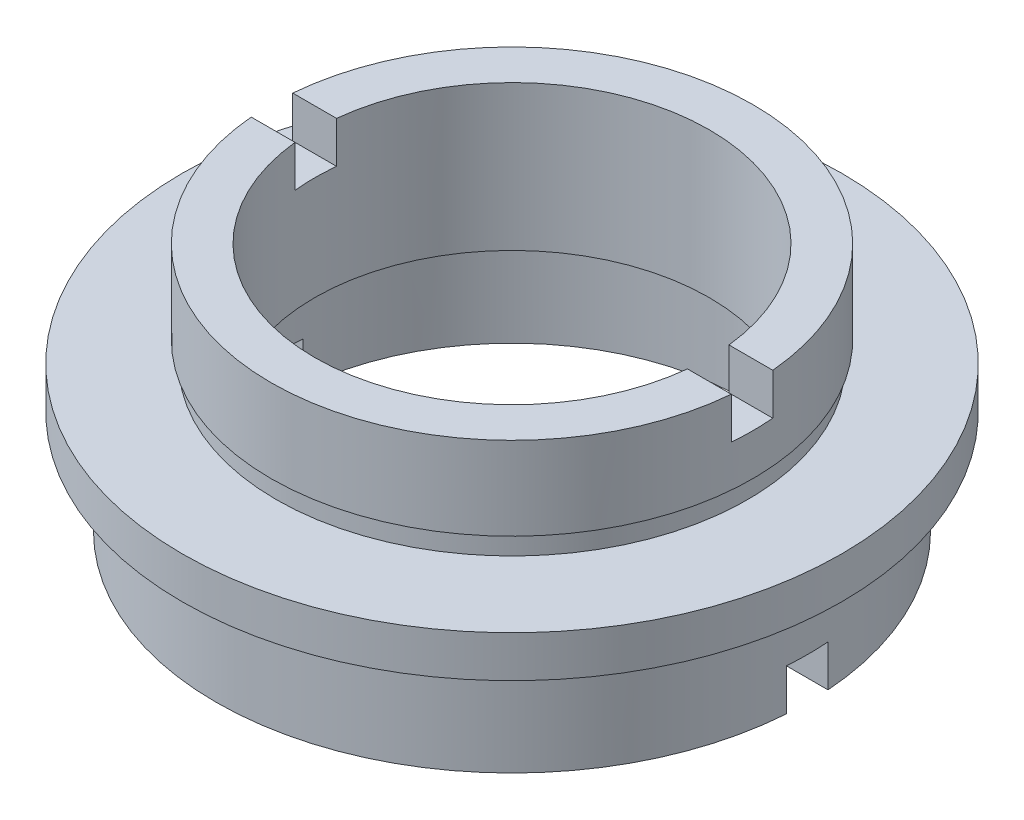
ISO-10303-21;
HEADER;
FILE_DESCRIPTION(('STEP AP214'),'2;1');
FILE_NAME('part.step','',(''),(''),'','','');
FILE_SCHEMA(('AUTOMOTIVE_DESIGN { 1 0 10303 214 1 1 1 1 }'));
ENDSEC;
DATA;
#1=APPLICATION_CONTEXT('core data for automotive mechanical design processes');
#2=APPLICATION_PROTOCOL_DEFINITION('international standard','automotive_design',2000,#1);
#3=PRODUCT_CONTEXT('',#1,'mechanical');
#4=PRODUCT('Part','Part','',(#3));
#5=PRODUCT_RELATED_PRODUCT_CATEGORY('part','',(#4));
#6=PRODUCT_DEFINITION_FORMATION('','',#4);
#7=PRODUCT_DEFINITION_CONTEXT('part definition',#1,'design');
#8=PRODUCT_DEFINITION('design','',#6,#7);
#9=PRODUCT_DEFINITION_SHAPE('','',#8);
#10=(LENGTH_UNIT() NAMED_UNIT(*) SI_UNIT(.MILLI.,.METRE.));
#11=(NAMED_UNIT(*) PLANE_ANGLE_UNIT() SI_UNIT($,.RADIAN.));
#12=(NAMED_UNIT(*) SI_UNIT($,.STERADIAN.) SOLID_ANGLE_UNIT());
#13=UNCERTAINTY_MEASURE_WITH_UNIT(LENGTH_MEASURE(1.E-05),#10,'distance_accuracy_value','');
#14=(GEOMETRIC_REPRESENTATION_CONTEXT(3) GLOBAL_UNCERTAINTY_ASSIGNED_CONTEXT((#13)) GLOBAL_UNIT_ASSIGNED_CONTEXT((#10,
#11,#12)) REPRESENTATION_CONTEXT('',''));
#15=CARTESIAN_POINT('',(0.,0.,0.));
#16=DIRECTION('',(0.,0.,1.));
#17=DIRECTION('',(1.,0.,0.));
#18=AXIS2_PLACEMENT_3D('',#15,#16,#17);
#19=CARTESIAN_POINT('',(-14.25,0.,0.));
#20=DIRECTION('',(0.,-1.,0.));
#21=DIRECTION('',(0.,0.,-1.));
#22=AXIS2_PLACEMENT_3D('',#19,#20,#21);
#23=PLANE('',#22);
#24=DIRECTION('',(-1.,0.,0.));
#25=VECTOR('',#24,1.);
#26=CARTESIAN_POINT('',(-14.25,0.,1.));
#27=LINE('',#26,#25);
#28=CARTESIAN_POINT('',(14.2148689758295,0.,1.));
#29=VERTEX_POINT('',#28);
#30=CARTESIAN_POINT('',(11.054863183233,0.,1.));
#31=VERTEX_POINT('',#30);
#32=EDGE_CURVE('E183',#29,#31,#27,.T.);
#33=ORIENTED_EDGE('',*,*,#32,.F.);
#34=CARTESIAN_POINT('',(0.,0.,0.));
#35=DIRECTION('',(0.,1.,0.));
#36=DIRECTION('',(0.,0.,1.));
#37=AXIS2_PLACEMENT_3D('',#34,#35,#36);
#38=CIRCLE('',#37,14.25);
#39=CARTESIAN_POINT('',(-14.2148689758295,0.,1.));
#40=VERTEX_POINT('',#39);
#41=EDGE_CURVE('E238',#40,#29,#38,.T.);
#42=ORIENTED_EDGE('',*,*,#41,.F.);
#43=CARTESIAN_POINT('',(-11.054863183233,0.,1.));
#44=VERTEX_POINT('',#43);
#45=EDGE_CURVE('E161',#44,#40,#27,.T.);
#46=ORIENTED_EDGE('',*,*,#45,.F.);
#47=CARTESIAN_POINT('',(0.,0.,0.));
#48=DIRECTION('',(0.,1.,0.));
#49=DIRECTION('',(0.,0.,1.));
#50=AXIS2_PLACEMENT_3D('',#47,#48,#49);
#51=CIRCLE('',#50,11.1);
#52=EDGE_CURVE('E234',#44,#31,#51,.T.);
#53=ORIENTED_EDGE('',*,*,#52,.T.);
#54=EDGE_LOOP('',(#33,#42,#46,#53));
#55=FACE_BOUND('',#54,.T.);
#56=ADVANCED_FACE('F38',(#55),#23,.T.);
#57=CARTESIAN_POINT('',(-9.5,12.,0.));
#58=DIRECTION('',(0.,1.,0.));
#59=DIRECTION('',(0.,0.,1.));
#60=AXIS2_PLACEMENT_3D('',#57,#58,#59);
#61=PLANE('',#60);
#62=DIRECTION('',(1.,0.,0.));
#63=VECTOR('',#62,1.);
#64=CARTESIAN_POINT('',(-9.5,12.,1.));
#65=LINE('',#64,#63);
#66=CARTESIAN_POINT('',(-11.5568161705549,12.,1.));
#67=VERTEX_POINT('',#66);
#68=CARTESIAN_POINT('',(-9.44722181384559,12.,1.));
#69=VERTEX_POINT('',#68);
#70=EDGE_CURVE('E270',#67,#69,#65,.T.);
#71=ORIENTED_EDGE('',*,*,#70,.F.);
#72=CARTESIAN_POINT('',(0.,12.,0.));
#73=DIRECTION('',(0.,1.,0.));
#74=DIRECTION('',(0.,0.,1.));
#75=AXIS2_PLACEMENT_3D('',#72,#73,#74);
#76=CIRCLE('',#75,11.6);
#77=CARTESIAN_POINT('',(11.5568161705549,12.,1.));
#78=VERTEX_POINT('',#77);
#79=EDGE_CURVE('E214',#67,#78,#76,.T.);
#80=ORIENTED_EDGE('',*,*,#79,.T.);
#81=CARTESIAN_POINT('',(9.44722181384559,12.,1.));
#82=VERTEX_POINT('',#81);
#83=EDGE_CURVE('E268',#82,#78,#65,.T.);
#84=ORIENTED_EDGE('',*,*,#83,.F.);
#85=CARTESIAN_POINT('',(0.,12.,0.));
#86=DIRECTION('',(0.,1.,0.));
#87=DIRECTION('',(0.,0.,1.));
#88=AXIS2_PLACEMENT_3D('',#85,#86,#87);
#89=CIRCLE('',#88,9.5);
#90=EDGE_CURVE('E218',#69,#82,#89,.T.);
#91=ORIENTED_EDGE('',*,*,#90,.F.);
#92=EDGE_LOOP('',(#71,#80,#84,#91));
#93=FACE_BOUND('',#92,.T.);
#94=ADVANCED_FACE('F319',(#93),#61,.T.);
#95=CARTESIAN_POINT('',(0.,22.6774994510759,0.));
#96=DIRECTION('',(0.,1.,0.));
#97=DIRECTION('',(0.,0.,1.));
#98=AXIS2_PLACEMENT_3D('',#95,#96,#97);
#99=CYLINDRICAL_SURFACE('',#98,11.6);
#100=DIRECTION('',(0.,1.,0.));
#101=VECTOR('',#100,1.);
#102=CARTESIAN_POINT('',(-11.5568161705549,22.6774994510759,1.));
#103=LINE('',#102,#101);
#104=CARTESIAN_POINT('',(-11.5568161705549,10.,1.));
#105=VERTEX_POINT('',#104);
#106=EDGE_CURVE('E209',#105,#67,#103,.T.);
#107=ORIENTED_EDGE('',*,*,#106,.F.);
#108=CARTESIAN_POINT('',(0.,10.,0.));
#109=DIRECTION('',(0.,-1.,0.));
#110=DIRECTION('',(0.,0.,-1.));
#111=AXIS2_PLACEMENT_3D('',#108,#109,#110);
#112=CIRCLE('',#111,11.6);
#113=CARTESIAN_POINT('',(-11.5568161705549,10.,-0.999999999999997));
#114=VERTEX_POINT('',#113);
#115=EDGE_CURVE('E213',#114,#105,#112,.F.);
#116=ORIENTED_EDGE('',*,*,#115,.F.);
#117=DIRECTION('',(0.,1.,0.));
#118=VECTOR('',#117,1.);
#119=CARTESIAN_POINT('',(-11.5568161705549,22.6774994510759,-1.));
#120=LINE('',#119,#118);
#121=CARTESIAN_POINT('',(-11.5568161705549,12.,-0.999999999999998));
#122=VERTEX_POINT('',#121);
#123=EDGE_CURVE('E197',#122,#114,#120,.F.);
#124=ORIENTED_EDGE('',*,*,#123,.F.);
#125=CARTESIAN_POINT('',(11.5568161705549,12.,-0.999999999999998));
#126=VERTEX_POINT('',#125);
#127=EDGE_CURVE('E217',#126,#122,#76,.T.);
#128=ORIENTED_EDGE('',*,*,#127,.F.);
#129=DIRECTION('',(0.,1.,0.));
#130=VECTOR('',#129,1.);
#131=CARTESIAN_POINT('',(11.5568161705549,22.6774994510759,-1.));
#132=LINE('',#131,#130);
#133=CARTESIAN_POINT('',(11.5568161705549,10.,-0.999999999999997));
#134=VERTEX_POINT('',#133);
#135=EDGE_CURVE('E201',#134,#126,#132,.T.);
#136=ORIENTED_EDGE('',*,*,#135,.F.);
#137=CARTESIAN_POINT('',(11.5568161705549,10.,1.));
#138=VERTEX_POINT('',#137);
#139=EDGE_CURVE('E211',#138,#134,#112,.F.);
#140=ORIENTED_EDGE('',*,*,#139,.F.);
#141=DIRECTION('',(0.,1.,0.));
#142=VECTOR('',#141,1.);
#143=CARTESIAN_POINT('',(11.5568161705549,22.6774994510759,1.));
#144=LINE('',#143,#142);
#145=EDGE_CURVE('E205',#78,#138,#144,.F.);
#146=ORIENTED_EDGE('',*,*,#145,.F.);
#147=ORIENTED_EDGE('',*,*,#79,.F.);
#148=EDGE_LOOP('',(#107,#116,#124,#128,#136,#140,#146,#147));
#149=FACE_BOUND('',#148,.T.);
#150=CARTESIAN_POINT('',(0.,8.,0.));
#151=DIRECTION('',(0.,1.,0.));
#152=DIRECTION('',(0.,0.,1.));
#153=AXIS2_PLACEMENT_3D('',#150,#151,#152);
#154=CIRCLE('',#153,11.6);
#155=CARTESIAN_POINT('',(0.,8.,11.6));
#156=VERTEX_POINT('',#155);
#157=EDGE_CURVE('E262',#156,#156,#154,.T.);
#158=ORIENTED_EDGE('',*,*,#157,.T.);
#159=EDGE_LOOP('',(#158));
#160=FACE_BOUND('',#159,.T.);
#161=ADVANCED_FACE('F40',(#149,#160),#99,.T.);
#162=CARTESIAN_POINT('',(-11.6,8.,0.));
#163=DIRECTION('',(0.,-1.,0.));
#164=DIRECTION('',(0.,0.,-1.));
#165=AXIS2_PLACEMENT_3D('',#162,#163,#164);
#166=PLANE('',#165);
#167=CARTESIAN_POINT('',(0.,8.,0.));
#168=DIRECTION('',(0.,1.,0.));
#169=DIRECTION('',(0.,0.,1.));
#170=AXIS2_PLACEMENT_3D('',#167,#168,#169);
#171=CIRCLE('',#170,11.35);
#172=CARTESIAN_POINT('',(0.,8.,11.35));
#173=VERTEX_POINT('',#172);
#174=EDGE_CURVE('E259',#173,#173,#171,.T.);
#175=ORIENTED_EDGE('',*,*,#174,.T.);
#176=EDGE_LOOP('',(#175));
#177=FACE_BOUND('',#176,.T.);
#178=ORIENTED_EDGE('',*,*,#157,.F.);
#179=EDGE_LOOP('',(#178));
#180=FACE_BOUND('',#179,.T.);
#181=ADVANCED_FACE('F329',(#177,#180),#166,.T.);
#182=CARTESIAN_POINT('',(0.,22.6774994510759,0.));
#183=DIRECTION('',(0.,1.,0.));
#184=DIRECTION('',(0.,0.,1.));
#185=AXIS2_PLACEMENT_3D('',#182,#183,#184);
#186=CYLINDRICAL_SURFACE('',#185,11.35);
#187=CARTESIAN_POINT('',(0.,7.,0.));
#188=DIRECTION('',(0.,1.,0.));
#189=DIRECTION('',(0.,0.,1.));
#190=AXIS2_PLACEMENT_3D('',#187,#188,#189);
#191=CIRCLE('',#190,11.35);
#192=CARTESIAN_POINT('',(0.,7.,11.35));
#193=VERTEX_POINT('',#192);
#194=EDGE_CURVE('E256',#193,#193,#191,.T.);
#195=ORIENTED_EDGE('',*,*,#194,.T.);
#196=EDGE_LOOP('',(#195));
#197=FACE_BOUND('',#196,.T.);
#198=ORIENTED_EDGE('',*,*,#174,.F.);
#199=EDGE_LOOP('',(#198));
#200=FACE_BOUND('',#199,.T.);
#201=ADVANCED_FACE('F569',(#197,#200),#186,.T.);
#202=CARTESIAN_POINT('',(-11.35,7.,0.));
#203=DIRECTION('',(0.,1.,0.));
#204=DIRECTION('',(0.,0.,1.));
#205=AXIS2_PLACEMENT_3D('',#202,#203,#204);
#206=PLANE('',#205);
#207=CARTESIAN_POINT('',(0.,7.,0.));
#208=DIRECTION('',(0.,1.,0.));
#209=DIRECTION('',(0.,0.,1.));
#210=AXIS2_PLACEMENT_3D('',#207,#208,#209);
#211=CIRCLE('',#210,15.875);
#212=CARTESIAN_POINT('',(0.,7.,15.875));
#213=VERTEX_POINT('',#212);
#214=EDGE_CURVE('E253',#213,#213,#211,.T.);
#215=ORIENTED_EDGE('',*,*,#214,.T.);
#216=EDGE_LOOP('',(#215));
#217=FACE_BOUND('',#216,.T.);
#218=ORIENTED_EDGE('',*,*,#194,.F.);
#219=EDGE_LOOP('',(#218));
#220=FACE_BOUND('',#219,.T.);
#221=ADVANCED_FACE('F560',(#217,#220),#206,.T.);
#222=CARTESIAN_POINT('',(0.,22.6774994510759,0.));
#223=DIRECTION('',(0.,1.,0.));
#224=DIRECTION('',(0.,0.,1.));
#225=AXIS2_PLACEMENT_3D('',#222,#223,#224);
#226=CYLINDRICAL_SURFACE('',#225,15.875);
#227=CARTESIAN_POINT('',(0.,5.,0.));
#228=DIRECTION('',(0.,1.,0.));
#229=DIRECTION('',(0.,0.,1.));
#230=AXIS2_PLACEMENT_3D('',#227,#228,#229);
#231=CIRCLE('',#230,15.875);
#232=CARTESIAN_POINT('',(0.,5.,15.875));
#233=VERTEX_POINT('',#232);
#234=EDGE_CURVE('E250',#233,#233,#231,.T.);
#235=ORIENTED_EDGE('',*,*,#234,.T.);
#236=EDGE_LOOP('',(#235));
#237=FACE_BOUND('',#236,.T.);
#238=ORIENTED_EDGE('',*,*,#214,.F.);
#239=EDGE_LOOP('',(#238));
#240=FACE_BOUND('',#239,.T.);
#241=ADVANCED_FACE('F551',(#237,#240),#226,.T.);
#242=CARTESIAN_POINT('',(-15.875,5.,0.));
#243=DIRECTION('',(0.,-1.,0.));
#244=DIRECTION('',(0.,0.,-1.));
#245=AXIS2_PLACEMENT_3D('',#242,#243,#244);
#246=PLANE('',#245);
#247=CARTESIAN_POINT('',(0.,5.,0.));
#248=DIRECTION('',(0.,1.,0.));
#249=DIRECTION('',(0.,0.,1.));
#250=AXIS2_PLACEMENT_3D('',#247,#248,#249);
#251=CIRCLE('',#250,13.75);
#252=CARTESIAN_POINT('',(0.,5.,13.75));
#253=VERTEX_POINT('',#252);
#254=EDGE_CURVE('E247',#253,#253,#251,.T.);
#255=ORIENTED_EDGE('',*,*,#254,.T.);
#256=EDGE_LOOP('',(#255));
#257=FACE_BOUND('',#256,.T.);
#258=ORIENTED_EDGE('',*,*,#234,.F.);
#259=EDGE_LOOP('',(#258));
#260=FACE_BOUND('',#259,.T.);
#261=ADVANCED_FACE('F542',(#257,#260),#246,.T.);
#262=CARTESIAN_POINT('',(0.,22.6774994510759,0.));
#263=DIRECTION('',(0.,1.,0.));
#264=DIRECTION('',(0.,0.,1.));
#265=AXIS2_PLACEMENT_3D('',#262,#263,#264);
#266=CYLINDRICAL_SURFACE('',#265,13.75);
#267=CARTESIAN_POINT('',(0.,4.,0.));
#268=DIRECTION('',(0.,1.,0.));
#269=DIRECTION('',(0.,0.,1.));
#270=AXIS2_PLACEMENT_3D('',#267,#268,#269);
#271=CIRCLE('',#270,13.75);
#272=CARTESIAN_POINT('',(0.,4.,13.75));
#273=VERTEX_POINT('',#272);
#274=EDGE_CURVE('E244',#273,#273,#271,.T.);
#275=ORIENTED_EDGE('',*,*,#274,.T.);
#276=EDGE_LOOP('',(#275));
#277=FACE_BOUND('',#276,.T.);
#278=ORIENTED_EDGE('',*,*,#254,.F.);
#279=EDGE_LOOP('',(#278));
#280=FACE_BOUND('',#279,.T.);
#281=ADVANCED_FACE('F533',(#277,#280),#266,.T.);
#282=CARTESIAN_POINT('',(-13.75,4.,0.));
#283=DIRECTION('',(0.,1.,0.));
#284=DIRECTION('',(0.,0.,1.));
#285=AXIS2_PLACEMENT_3D('',#282,#283,#284);
#286=PLANE('',#285);
#287=CARTESIAN_POINT('',(0.,4.,0.));
#288=DIRECTION('',(0.,1.,0.));
#289=DIRECTION('',(0.,0.,1.));
#290=AXIS2_PLACEMENT_3D('',#287,#288,#289);
#291=CIRCLE('',#290,14.25);
#292=CARTESIAN_POINT('',(0.,4.,14.25));
#293=VERTEX_POINT('',#292);
#294=EDGE_CURVE('E241',#293,#293,#291,.T.);
#295=ORIENTED_EDGE('',*,*,#294,.T.);
#296=EDGE_LOOP('',(#295));
#297=FACE_BOUND('',#296,.T.);
#298=ORIENTED_EDGE('',*,*,#274,.F.);
#299=EDGE_LOOP('',(#298));
#300=FACE_BOUND('',#299,.T.);
#301=ADVANCED_FACE('F316',(#297,#300),#286,.T.);
#302=CARTESIAN_POINT('',(0.,22.6774994510759,0.));
#303=DIRECTION('',(0.,1.,0.));
#304=DIRECTION('',(0.,0.,1.));
#305=AXIS2_PLACEMENT_3D('',#302,#303,#304);
#306=CYLINDRICAL_SURFACE('',#305,14.25);
#307=DIRECTION('',(0.,1.,0.));
#308=VECTOR('',#307,1.);
#309=CARTESIAN_POINT('',(-14.2148689758295,22.6774994510759,1.));
#310=LINE('',#309,#308);
#311=CARTESIAN_POINT('',(-14.2148689758295,2.,1.));
#312=VERTEX_POINT('',#311);
#313=EDGE_CURVE('E182',#40,#312,#310,.T.);
#314=ORIENTED_EDGE('',*,*,#313,.F.);
#315=ORIENTED_EDGE('',*,*,#41,.T.);
#316=DIRECTION('',(0.,1.,0.));
#317=VECTOR('',#316,1.);
#318=CARTESIAN_POINT('',(14.2148689758295,22.6774994510759,1.));
#319=LINE('',#318,#317);
#320=CARTESIAN_POINT('',(14.2148689758295,2.,1.));
#321=VERTEX_POINT('',#320);
#322=EDGE_CURVE('E185',#321,#29,#319,.F.);
#323=ORIENTED_EDGE('',*,*,#322,.F.);
#324=CARTESIAN_POINT('',(0.,2.,0.));
#325=DIRECTION('',(0.,1.,0.));
#326=DIRECTION('',(0.,0.,1.));
#327=AXIS2_PLACEMENT_3D('',#324,#325,#326);
#328=CIRCLE('',#327,14.25);
#329=CARTESIAN_POINT('',(14.2148689758295,2.,-1.));
#330=VERTEX_POINT('',#329);
#331=EDGE_CURVE('E162',#330,#321,#328,.F.);
#332=ORIENTED_EDGE('',*,*,#331,.F.);
#333=DIRECTION('',(0.,1.,0.));
#334=VECTOR('',#333,1.);
#335=CARTESIAN_POINT('',(14.2148689758295,22.6774994510759,-0.999999999999994));
#336=LINE('',#335,#334);
#337=CARTESIAN_POINT('',(14.2148689758295,0.,-1.));
#338=VERTEX_POINT('',#337);
#339=EDGE_CURVE('E176',#338,#330,#336,.T.);
#340=ORIENTED_EDGE('',*,*,#339,.F.);
#341=CARTESIAN_POINT('',(-14.2148689758295,0.,-1.));
#342=VERTEX_POINT('',#341);
#343=EDGE_CURVE('E174',#338,#342,#38,.T.);
#344=ORIENTED_EDGE('',*,*,#343,.T.);
#345=DIRECTION('',(0.,1.,0.));
#346=VECTOR('',#345,1.);
#347=CARTESIAN_POINT('',(-14.2148689758295,22.6774994510759,-0.999999999999994));
#348=LINE('',#347,#346);
#349=CARTESIAN_POINT('',(-14.2148689758295,2.,-1.));
#350=VERTEX_POINT('',#349);
#351=EDGE_CURVE('E165',#350,#342,#348,.F.);
#352=ORIENTED_EDGE('',*,*,#351,.F.);
#353=EDGE_CURVE('E151',#312,#350,#328,.F.);
#354=ORIENTED_EDGE('',*,*,#353,.F.);
#355=EDGE_LOOP('',(#314,#315,#323,#332,#340,#344,#352,#354));
#356=FACE_BOUND('',#355,.T.);
#357=ORIENTED_EDGE('',*,*,#294,.F.);
#358=EDGE_LOOP('',(#357));
#359=FACE_BOUND('',#358,.T.);
#360=ADVANCED_FACE('F170',(#356,#359),#306,.T.);
#361=DIRECTION('',(1.,0.,0.));
#362=VECTOR('',#361,1.);
#363=CARTESIAN_POINT('',(-14.25,0.,-1.));
#364=LINE('',#363,#362);
#365=CARTESIAN_POINT('',(-11.054863183233,0.,-0.999999999999995));
#366=VERTEX_POINT('',#365);
#367=EDGE_CURVE('E61',#342,#366,#364,.T.);
#368=ORIENTED_EDGE('',*,*,#367,.F.);
#369=ORIENTED_EDGE('',*,*,#343,.F.);
#370=CARTESIAN_POINT('',(11.054863183233,0.,-0.999999999999994));
#371=VERTEX_POINT('',#370);
#372=EDGE_CURVE('E178',#371,#338,#364,.T.);
#373=ORIENTED_EDGE('',*,*,#372,.F.);
#374=EDGE_CURVE('E237',#371,#366,#51,.T.);
#375=ORIENTED_EDGE('',*,*,#374,.T.);
#376=EDGE_LOOP('',(#368,#369,#373,#375));
#377=FACE_BOUND('',#376,.T.);
#378=ADVANCED_FACE('F307',(#377),#23,.T.);
#379=CARTESIAN_POINT('',(0.,22.6774994510759,0.));
#380=DIRECTION('',(0.,1.,0.));
#381=DIRECTION('',(0.,0.,1.));
#382=AXIS2_PLACEMENT_3D('',#379,#380,#381);
#383=CYLINDRICAL_SURFACE('',#382,11.1);
#384=DIRECTION('',(0.,1.,0.));
#385=VECTOR('',#384,1.);
#386=CARTESIAN_POINT('',(-11.054863183233,22.6774994510759,1.));
#387=LINE('',#386,#385);
#388=CARTESIAN_POINT('',(-11.054863183233,2.,1.));
#389=VERTEX_POINT('',#388);
#390=EDGE_CURVE('E12',#389,#44,#387,.F.);
#391=ORIENTED_EDGE('',*,*,#390,.F.);
#392=CARTESIAN_POINT('',(0.,2.,0.));
#393=DIRECTION('',(0.,1.,0.));
#394=DIRECTION('',(0.,0.,1.));
#395=AXIS2_PLACEMENT_3D('',#392,#393,#394);
#396=CIRCLE('',#395,11.1);
#397=CARTESIAN_POINT('',(-11.054863183233,2.,-1.));
#398=VERTEX_POINT('',#397);
#399=EDGE_CURVE('E46',#398,#389,#396,.T.);
#400=ORIENTED_EDGE('',*,*,#399,.F.);
#401=DIRECTION('',(0.,1.,0.));
#402=VECTOR('',#401,1.);
#403=CARTESIAN_POINT('',(-11.054863183233,22.6774994510759,-0.999999999999994));
#404=LINE('',#403,#402);
#405=EDGE_CURVE('E166',#366,#398,#404,.T.);
#406=ORIENTED_EDGE('',*,*,#405,.F.);
#407=ORIENTED_EDGE('',*,*,#374,.F.);
#408=DIRECTION('',(0.,1.,0.));
#409=VECTOR('',#408,1.);
#410=CARTESIAN_POINT('',(11.054863183233,22.6774994510759,-0.999999999999994));
#411=LINE('',#410,#409);
#412=CARTESIAN_POINT('',(11.054863183233,2.,-0.999999999999994));
#413=VERTEX_POINT('',#412);
#414=EDGE_CURVE('E274',#413,#371,#411,.F.);
#415=ORIENTED_EDGE('',*,*,#414,.F.);
#416=CARTESIAN_POINT('',(11.054863183233,2.,1.));
#417=VERTEX_POINT('',#416);
#418=EDGE_CURVE('E276',#417,#413,#396,.T.);
#419=ORIENTED_EDGE('',*,*,#418,.F.);
#420=DIRECTION('',(0.,1.,0.));
#421=VECTOR('',#420,1.);
#422=CARTESIAN_POINT('',(11.054863183233,22.6774994510759,1.));
#423=LINE('',#422,#421);
#424=EDGE_CURVE('E278',#31,#417,#423,.T.);
#425=ORIENTED_EDGE('',*,*,#424,.F.);
#426=ORIENTED_EDGE('',*,*,#52,.F.);
#427=EDGE_LOOP('',(#391,#400,#406,#407,#415,#419,#425,#426));
#428=FACE_BOUND('',#427,.T.);
#429=CARTESIAN_POINT('',(0.,4.,0.));
#430=DIRECTION('',(0.,1.,0.));
#431=DIRECTION('',(0.,0.,1.));
#432=AXIS2_PLACEMENT_3D('',#429,#430,#431);
#433=CIRCLE('',#432,11.1);
#434=CARTESIAN_POINT('',(0.,4.,11.1));
#435=VERTEX_POINT('',#434);
#436=EDGE_CURVE('E231',#435,#435,#433,.T.);
#437=ORIENTED_EDGE('',*,*,#436,.T.);
#438=EDGE_LOOP('',(#437));
#439=FACE_BOUND('',#438,.T.);
#440=ADVANCED_FACE('F286',(#428,#439),#383,.F.);
#441=CARTESIAN_POINT('',(-11.7,4.,0.));
#442=DIRECTION('',(0.,1.,0.));
#443=DIRECTION('',(0.,0.,1.));
#444=AXIS2_PLACEMENT_3D('',#441,#442,#443);
#445=PLANE('',#444);
#446=CARTESIAN_POINT('',(0.,4.,0.));
#447=DIRECTION('',(0.,1.,0.));
#448=DIRECTION('',(0.,0.,1.));
#449=AXIS2_PLACEMENT_3D('',#446,#447,#448);
#450=CIRCLE('',#449,11.7);
#451=CARTESIAN_POINT('',(0.,4.,11.7));
#452=VERTEX_POINT('',#451);
#453=EDGE_CURVE('E228',#452,#452,#450,.T.);
#454=ORIENTED_EDGE('',*,*,#453,.T.);
#455=EDGE_LOOP('',(#454));
#456=FACE_BOUND('',#455,.T.);
#457=ORIENTED_EDGE('',*,*,#436,.F.);
#458=EDGE_LOOP('',(#457));
#459=FACE_BOUND('',#458,.T.);
#460=ADVANCED_FACE('F314',(#456,#459),#445,.T.);
#461=CARTESIAN_POINT('',(0.,22.6774994510759,0.));
#462=DIRECTION('',(0.,1.,0.));
#463=DIRECTION('',(0.,0.,1.));
#464=AXIS2_PLACEMENT_3D('',#461,#462,#463);
#465=CYLINDRICAL_SURFACE('',#464,11.7);
#466=CARTESIAN_POINT('',(0.,5.,0.));
#467=DIRECTION('',(0.,1.,0.));
#468=DIRECTION('',(0.,0.,1.));
#469=AXIS2_PLACEMENT_3D('',#466,#467,#468);
#470=CIRCLE('',#469,11.7);
#471=CARTESIAN_POINT('',(0.,5.,11.7));
#472=VERTEX_POINT('',#471);
#473=EDGE_CURVE('E225',#472,#472,#470,.T.);
#474=ORIENTED_EDGE('',*,*,#473,.T.);
#475=EDGE_LOOP('',(#474));
#476=FACE_BOUND('',#475,.T.);
#477=ORIENTED_EDGE('',*,*,#453,.F.);
#478=EDGE_LOOP('',(#477));
#479=FACE_BOUND('',#478,.T.);
#480=ADVANCED_FACE('F492',(#476,#479),#465,.F.);
#481=CARTESIAN_POINT('',(-9.5,5.,0.));
#482=DIRECTION('',(0.,-1.,0.));
#483=DIRECTION('',(0.,0.,-1.));
#484=AXIS2_PLACEMENT_3D('',#481,#482,#483);
#485=PLANE('',#484);
#486=CARTESIAN_POINT('',(0.,5.,0.));
#487=DIRECTION('',(0.,1.,0.));
#488=DIRECTION('',(0.,0.,1.));
#489=AXIS2_PLACEMENT_3D('',#486,#487,#488);
#490=CIRCLE('',#489,9.5);
#491=CARTESIAN_POINT('',(0.,5.,9.5));
#492=VERTEX_POINT('',#491);
#493=EDGE_CURVE('E222',#492,#492,#490,.T.);
#494=ORIENTED_EDGE('',*,*,#493,.T.);
#495=EDGE_LOOP('',(#494));
#496=FACE_BOUND('',#495,.T.);
#497=ORIENTED_EDGE('',*,*,#473,.F.);
#498=EDGE_LOOP('',(#497));
#499=FACE_BOUND('',#498,.T.);
#500=ADVANCED_FACE('F345',(#496,#499),#485,.T.);
#501=CARTESIAN_POINT('',(0.,22.6774994510759,0.));
#502=DIRECTION('',(0.,1.,0.));
#503=DIRECTION('',(0.,0.,1.));
#504=AXIS2_PLACEMENT_3D('',#501,#502,#503);
#505=CYLINDRICAL_SURFACE('',#504,9.5);
#506=DIRECTION('',(0.,1.,0.));
#507=VECTOR('',#506,1.);
#508=CARTESIAN_POINT('',(9.44722181384559,22.6774994510759,1.));
#509=LINE('',#508,#507);
#510=CARTESIAN_POINT('',(9.44722181384559,10.,1.));
#511=VERTEX_POINT('',#510);
#512=EDGE_CURVE('E203',#511,#82,#509,.T.);
#513=ORIENTED_EDGE('',*,*,#512,.F.);
#514=CARTESIAN_POINT('',(0.,10.,0.));
#515=DIRECTION('',(0.,-1.,0.));
#516=DIRECTION('',(0.,0.,-1.));
#517=AXIS2_PLACEMENT_3D('',#514,#515,#516);
#518=CIRCLE('',#517,9.5);
#519=CARTESIAN_POINT('',(9.44722181384559,10.,-0.999999999999997));
#520=VERTEX_POINT('',#519);
#521=EDGE_CURVE('E273',#520,#511,#518,.T.);
#522=ORIENTED_EDGE('',*,*,#521,.F.);
#523=DIRECTION('',(0.,1.,0.));
#524=VECTOR('',#523,1.);
#525=CARTESIAN_POINT('',(9.44722181384559,22.6774994510759,-1.));
#526=LINE('',#525,#524);
#527=CARTESIAN_POINT('',(9.44722181384559,12.,-0.999999999999998));
#528=VERTEX_POINT('',#527);
#529=EDGE_CURVE('E199',#528,#520,#526,.F.);
#530=ORIENTED_EDGE('',*,*,#529,.F.);
#531=CARTESIAN_POINT('',(-9.44722181384559,12.,-0.999999999999998));
#532=VERTEX_POINT('',#531);
#533=EDGE_CURVE('E221',#528,#532,#89,.T.);
#534=ORIENTED_EDGE('',*,*,#533,.T.);
#535=DIRECTION('',(0.,1.,0.));
#536=VECTOR('',#535,1.);
#537=CARTESIAN_POINT('',(-9.44722181384559,22.6774994510759,-1.));
#538=LINE('',#537,#536);
#539=CARTESIAN_POINT('',(-9.44722181384559,10.,-0.999999999999997));
#540=VERTEX_POINT('',#539);
#541=EDGE_CURVE('E195',#540,#532,#538,.T.);
#542=ORIENTED_EDGE('',*,*,#541,.F.);
#543=CARTESIAN_POINT('',(-9.44722181384559,10.,1.));
#544=VERTEX_POINT('',#543);
#545=EDGE_CURVE('E271',#544,#540,#518,.T.);
#546=ORIENTED_EDGE('',*,*,#545,.F.);
#547=DIRECTION('',(0.,1.,0.));
#548=VECTOR('',#547,1.);
#549=CARTESIAN_POINT('',(-9.44722181384559,22.6774994510759,1.));
#550=LINE('',#549,#548);
#551=EDGE_CURVE('E207',#69,#544,#550,.F.);
#552=ORIENTED_EDGE('',*,*,#551,.F.);
#553=ORIENTED_EDGE('',*,*,#90,.T.);
#554=EDGE_LOOP('',(#513,#522,#530,#534,#542,#546,#552,#553));
#555=FACE_BOUND('',#554,.T.);
#556=ORIENTED_EDGE('',*,*,#493,.F.);
#557=EDGE_LOOP('',(#556));
#558=FACE_BOUND('',#557,.T.);
#559=ADVANCED_FACE('F336',(#555,#558),#505,.F.);
#560=DIRECTION('',(-1.,0.,0.));
#561=VECTOR('',#560,1.);
#562=CARTESIAN_POINT('',(-9.5,12.,-0.999999999999998));
#563=LINE('',#562,#561);
#564=EDGE_CURVE('E267',#126,#528,#563,.T.);
#565=ORIENTED_EDGE('',*,*,#564,.F.);
#566=ORIENTED_EDGE('',*,*,#127,.T.);
#567=EDGE_CURVE('E265',#532,#122,#563,.T.);
#568=ORIENTED_EDGE('',*,*,#567,.F.);
#569=ORIENTED_EDGE('',*,*,#533,.F.);
#570=EDGE_LOOP('',(#565,#566,#568,#569));
#571=FACE_BOUND('',#570,.T.);
#572=ADVANCED_FACE('F325',(#571),#61,.T.);
#573=CARTESIAN_POINT('',(-39.5,13.5939878717808,1.));
#574=DIRECTION('',(0.,0.,1.));
#575=DIRECTION('',(0.,-1.,0.));
#576=AXIS2_PLACEMENT_3D('',#573,#574,#575);
#577=PLANE('',#576);
#578=ORIENTED_EDGE('',*,*,#106,.T.);
#579=ORIENTED_EDGE('',*,*,#70,.T.);
#580=ORIENTED_EDGE('',*,*,#551,.T.);
#581=DIRECTION('',(1.,0.,0.));
#582=VECTOR('',#581,1.);
#583=CARTESIAN_POINT('',(-39.5,10.,1.));
#584=LINE('',#583,#582);
#585=EDGE_CURVE('E192',#105,#544,#584,.T.);
#586=ORIENTED_EDGE('',*,*,#585,.F.);
#587=EDGE_LOOP('',(#578,#579,#580,#586));
#588=FACE_BOUND('',#587,.T.);
#589=ADVANCED_FACE('F335',(#588),#577,.F.);
#590=CARTESIAN_POINT('',(-39.5,13.5939878717808,-0.999999999999998));
#591=DIRECTION('',(0.,0.,-1.));
#592=DIRECTION('',(0.,1.,0.));
#593=AXIS2_PLACEMENT_3D('',#590,#591,#592);
#594=PLANE('',#593);
#595=ORIENTED_EDGE('',*,*,#123,.T.);
#596=DIRECTION('',(1.,0.,0.));
#597=VECTOR('',#596,1.);
#598=CARTESIAN_POINT('',(-39.5,10.,-0.999999999999997));
#599=LINE('',#598,#597);
#600=EDGE_CURVE('E191',#114,#540,#599,.T.);
#601=ORIENTED_EDGE('',*,*,#600,.T.);
#602=ORIENTED_EDGE('',*,*,#541,.T.);
#603=ORIENTED_EDGE('',*,*,#567,.T.);
#604=EDGE_LOOP('',(#595,#601,#602,#603));
#605=FACE_BOUND('',#604,.T.);
#606=ADVANCED_FACE('F342',(#605),#594,.F.);
#607=CARTESIAN_POINT('',(-39.5,10.,1.));
#608=DIRECTION('',(0.,-1.,0.));
#609=DIRECTION('',(0.,0.,-1.));
#610=AXIS2_PLACEMENT_3D('',#607,#608,#609);
#611=PLANE('',#610);
#612=ORIENTED_EDGE('',*,*,#115,.T.);
#613=ORIENTED_EDGE('',*,*,#585,.T.);
#614=ORIENTED_EDGE('',*,*,#545,.T.);
#615=ORIENTED_EDGE('',*,*,#600,.F.);
#616=EDGE_LOOP('',(#612,#613,#614,#615));
#617=FACE_BOUND('',#616,.T.);
#618=ADVANCED_FACE('F366',(#617),#611,.F.);
#619=ORIENTED_EDGE('',*,*,#139,.T.);
#620=EDGE_CURVE('E188',#520,#134,#599,.T.);
#621=ORIENTED_EDGE('',*,*,#620,.F.);
#622=ORIENTED_EDGE('',*,*,#521,.T.);
#623=EDGE_CURVE('E187',#511,#138,#584,.T.);
#624=ORIENTED_EDGE('',*,*,#623,.T.);
#625=EDGE_LOOP('',(#619,#621,#622,#624));
#626=FACE_BOUND('',#625,.T.);
#627=ADVANCED_FACE('F378',(#626),#611,.F.);
#628=ORIENTED_EDGE('',*,*,#135,.T.);
#629=ORIENTED_EDGE('',*,*,#564,.T.);
#630=ORIENTED_EDGE('',*,*,#529,.T.);
#631=ORIENTED_EDGE('',*,*,#620,.T.);
#632=EDGE_LOOP('',(#628,#629,#630,#631));
#633=FACE_BOUND('',#632,.T.);
#634=ADVANCED_FACE('F376',(#633),#594,.F.);
#635=ORIENTED_EDGE('',*,*,#145,.T.);
#636=ORIENTED_EDGE('',*,*,#623,.F.);
#637=ORIENTED_EDGE('',*,*,#512,.T.);
#638=ORIENTED_EDGE('',*,*,#83,.T.);
#639=EDGE_LOOP('',(#635,#636,#637,#638));
#640=FACE_BOUND('',#639,.T.);
#641=ADVANCED_FACE('F344',(#640),#577,.F.);
#642=CARTESIAN_POINT('',(-39.5,2.,-1.));
#643=DIRECTION('',(0.,0.,-1.));
#644=DIRECTION('',(0.,1.,0.));
#645=AXIS2_PLACEMENT_3D('',#642,#643,#644);
#646=PLANE('',#645);
#647=ORIENTED_EDGE('',*,*,#339,.T.);
#648=DIRECTION('',(1.,0.,0.));
#649=VECTOR('',#648,1.);
#650=CARTESIAN_POINT('',(-39.5,2.,-1.));
#651=LINE('',#650,#649);
#652=EDGE_CURVE('E53',#413,#330,#651,.T.);
#653=ORIENTED_EDGE('',*,*,#652,.F.);
#654=ORIENTED_EDGE('',*,*,#414,.T.);
#655=ORIENTED_EDGE('',*,*,#372,.T.);
#656=EDGE_LOOP('',(#647,#653,#654,#655));
#657=FACE_BOUND('',#656,.T.);
#658=ADVANCED_FACE('F301',(#657),#646,.F.);
#659=CARTESIAN_POINT('',(-39.5,2.,1.));
#660=DIRECTION('',(0.,1.,0.));
#661=DIRECTION('',(0.,0.,1.));
#662=AXIS2_PLACEMENT_3D('',#659,#660,#661);
#663=PLANE('',#662);
#664=ORIENTED_EDGE('',*,*,#331,.T.);
#665=DIRECTION('',(1.,0.,0.));
#666=VECTOR('',#665,1.);
#667=CARTESIAN_POINT('',(-39.5,2.,1.));
#668=LINE('',#667,#666);
#669=EDGE_CURVE('E167',#417,#321,#668,.T.);
#670=ORIENTED_EDGE('',*,*,#669,.F.);
#671=ORIENTED_EDGE('',*,*,#418,.T.);
#672=ORIENTED_EDGE('',*,*,#652,.T.);
#673=EDGE_LOOP('',(#664,#670,#671,#672));
#674=FACE_BOUND('',#673,.T.);
#675=ADVANCED_FACE('F302',(#674),#663,.F.);
#676=CARTESIAN_POINT('',(-39.5,2.,1.));
#677=DIRECTION('',(0.,0.,1.));
#678=DIRECTION('',(0.,-1.,0.));
#679=AXIS2_PLACEMENT_3D('',#676,#677,#678);
#680=PLANE('',#679);
#681=ORIENTED_EDGE('',*,*,#322,.T.);
#682=ORIENTED_EDGE('',*,*,#32,.T.);
#683=ORIENTED_EDGE('',*,*,#424,.T.);
#684=ORIENTED_EDGE('',*,*,#669,.T.);
#685=EDGE_LOOP('',(#681,#682,#683,#684));
#686=FACE_BOUND('',#685,.T.);
#687=ADVANCED_FACE('F297',(#686),#680,.F.);
#688=ORIENTED_EDGE('',*,*,#351,.T.);
#689=ORIENTED_EDGE('',*,*,#367,.T.);
#690=ORIENTED_EDGE('',*,*,#405,.T.);
#691=EDGE_CURVE('E154',#350,#398,#651,.T.);
#692=ORIENTED_EDGE('',*,*,#691,.F.);
#693=EDGE_LOOP('',(#688,#689,#690,#692));
#694=FACE_BOUND('',#693,.T.);
#695=ADVANCED_FACE('F164',(#694),#646,.F.);
#696=ORIENTED_EDGE('',*,*,#313,.T.);
#697=EDGE_CURVE('E157',#312,#389,#668,.T.);
#698=ORIENTED_EDGE('',*,*,#697,.T.);
#699=ORIENTED_EDGE('',*,*,#390,.T.);
#700=ORIENTED_EDGE('',*,*,#45,.T.);
#701=EDGE_LOOP('',(#696,#698,#699,#700));
#702=FACE_BOUND('',#701,.T.);
#703=ADVANCED_FACE('F282',(#702),#680,.F.);
#704=ORIENTED_EDGE('',*,*,#353,.T.);
#705=ORIENTED_EDGE('',*,*,#691,.T.);
#706=ORIENTED_EDGE('',*,*,#399,.T.);
#707=ORIENTED_EDGE('',*,*,#697,.F.);
#708=EDGE_LOOP('',(#704,#705,#706,#707));
#709=FACE_BOUND('',#708,.T.);
#710=ADVANCED_FACE('F153',(#709),#663,.F.);
#711=CLOSED_SHELL('',(#56,#94,#161,#181,#201,#221,#241,#261,#281,#301,#360,#378,#440,#460,#480,
#500,#559,#572,#589,#606,#618,#627,#634,#641,#658,#675,#687,#695,#703,#710));
#712=MANIFOLD_SOLID_BREP('B2',#711);
#713=ADVANCED_BREP_SHAPE_REPRESENTATION('',(#18,#712),#14);
#714=SHAPE_DEFINITION_REPRESENTATION(#9,#713);
ENDSEC;
END-ISO-10303-21;
